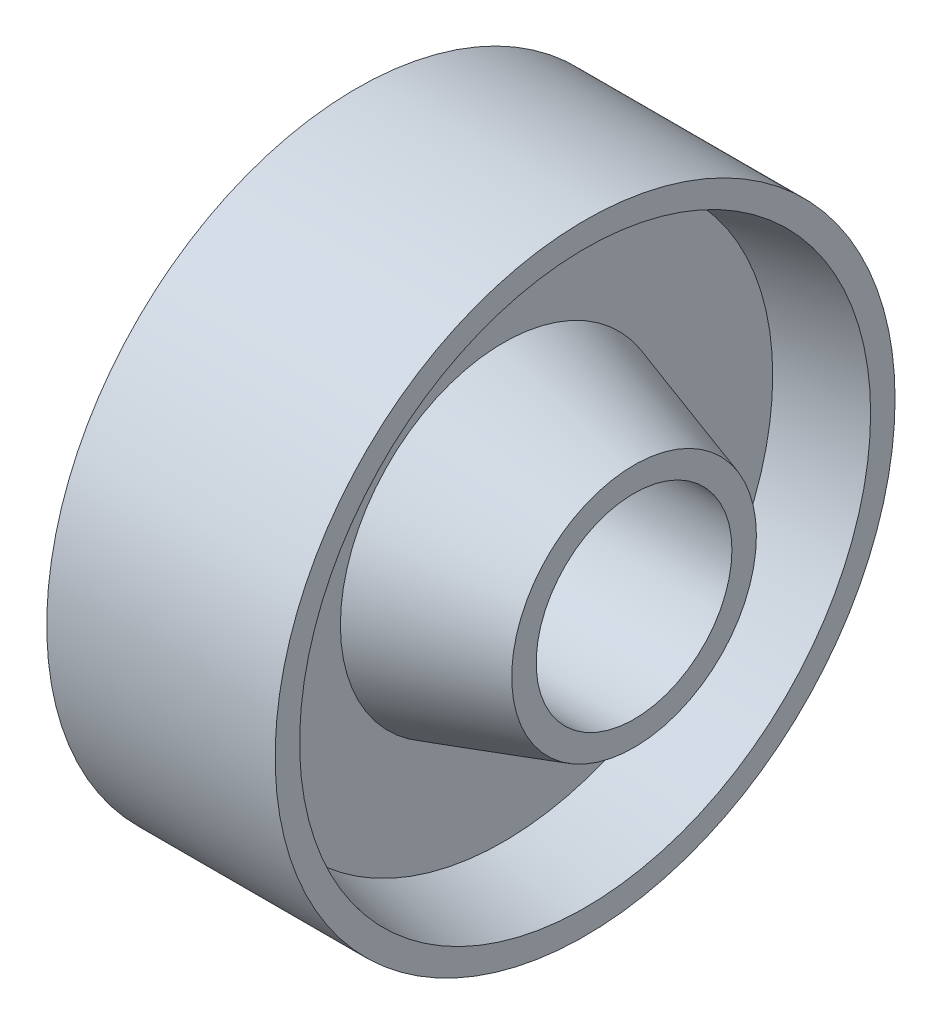
ISO-10303-21;
HEADER;
FILE_DESCRIPTION(('STEP AP214'),'2;1');
FILE_NAME('part.step','',(''),(''),'','','');
FILE_SCHEMA(('AUTOMOTIVE_DESIGN { 1 0 10303 214 1 1 1 1 }'));
ENDSEC;
DATA;
#1=APPLICATION_CONTEXT('core data for automotive mechanical design processes');
#2=APPLICATION_PROTOCOL_DEFINITION('international standard','automotive_design',2000,#1);
#3=PRODUCT_CONTEXT('',#1,'mechanical');
#4=PRODUCT('Part','Part','',(#3));
#5=PRODUCT_RELATED_PRODUCT_CATEGORY('part','',(#4));
#6=PRODUCT_DEFINITION_FORMATION('','',#4);
#7=PRODUCT_DEFINITION_CONTEXT('part definition',#1,'design');
#8=PRODUCT_DEFINITION('design','',#6,#7);
#9=PRODUCT_DEFINITION_SHAPE('','',#8);
#10=(LENGTH_UNIT() NAMED_UNIT(*) SI_UNIT(.MILLI.,.METRE.));
#11=(NAMED_UNIT(*) PLANE_ANGLE_UNIT() SI_UNIT($,.RADIAN.));
#12=(NAMED_UNIT(*) SI_UNIT($,.STERADIAN.) SOLID_ANGLE_UNIT());
#13=UNCERTAINTY_MEASURE_WITH_UNIT(LENGTH_MEASURE(1.E-05),#10,'distance_accuracy_value','');
#14=(GEOMETRIC_REPRESENTATION_CONTEXT(3) GLOBAL_UNCERTAINTY_ASSIGNED_CONTEXT((#13)) GLOBAL_UNIT_ASSIGNED_CONTEXT((#10,
#11,#12)) REPRESENTATION_CONTEXT('',''));
#15=CARTESIAN_POINT('',(0.,0.,0.));
#16=DIRECTION('',(0.,0.,1.));
#17=DIRECTION('',(1.,0.,0.));
#18=AXIS2_PLACEMENT_3D('',#15,#16,#17);
#19=CARTESIAN_POINT('',(90.0086496402296,0.,0.));
#20=DIRECTION('',(1.,0.,0.));
#21=DIRECTION('',(0.,0.,-1.));
#22=AXIS2_PLACEMENT_3D('',#19,#20,#21);
#23=CYLINDRICAL_SURFACE('',#22,12.);
#24=CARTESIAN_POINT('',(20.,0.,0.));
#25=DIRECTION('',(1.,0.,0.));
#26=DIRECTION('',(0.,0.,-1.));
#27=AXIS2_PLACEMENT_3D('',#24,#25,#26);
#28=CIRCLE('',#27,12.);
#29=CARTESIAN_POINT('',(20.,0.,-12.));
#30=VERTEX_POINT('',#29);
#31=EDGE_CURVE('E10',#30,#30,#28,.T.);
#32=ORIENTED_EDGE('',*,*,#31,.T.);
#33=EDGE_LOOP('',(#32));
#34=FACE_BOUND('',#33,.T.);
#35=CARTESIAN_POINT('',(-20.,0.,0.));
#36=DIRECTION('',(1.,0.,0.));
#37=DIRECTION('',(0.,0.,-1.));
#38=AXIS2_PLACEMENT_3D('',#35,#36,#37);
#39=CIRCLE('',#38,12.);
#40=CARTESIAN_POINT('',(-20.,0.,-12.));
#41=VERTEX_POINT('',#40);
#42=EDGE_CURVE('E71',#41,#41,#39,.T.);
#43=ORIENTED_EDGE('',*,*,#42,.F.);
#44=EDGE_LOOP('',(#43));
#45=FACE_BOUND('',#44,.T.);
#46=ADVANCED_FACE('F31',(#34,#45),#23,.F.);
#47=CARTESIAN_POINT('',(20.,12.,0.));
#48=DIRECTION('',(1.,0.,0.));
#49=DIRECTION('',(0.,0.,-1.));
#50=AXIS2_PLACEMENT_3D('',#47,#48,#49);
#51=PLANE('',#50);
#52=CARTESIAN_POINT('',(20.,0.,0.));
#53=DIRECTION('',(1.,0.,0.));
#54=DIRECTION('',(0.,0.,-1.));
#55=AXIS2_PLACEMENT_3D('',#52,#53,#54);
#56=CIRCLE('',#55,15.);
#57=CARTESIAN_POINT('',(20.,0.,-15.));
#58=VERTEX_POINT('',#57);
#59=EDGE_CURVE('E37',#58,#58,#56,.T.);
#60=ORIENTED_EDGE('',*,*,#59,.T.);
#61=EDGE_LOOP('',(#60));
#62=FACE_BOUND('',#61,.T.);
#63=ORIENTED_EDGE('',*,*,#31,.F.);
#64=EDGE_LOOP('',(#63));
#65=FACE_BOUND('',#64,.T.);
#66=ADVANCED_FACE('F79',(#62,#65),#51,.T.);
#67=CARTESIAN_POINT('',(20.,0.,0.));
#68=DIRECTION('',(-1.,0.,0.));
#69=DIRECTION('',(0.,0.,1.));
#70=AXIS2_PLACEMENT_3D('',#67,#68,#69);
#71=CONICAL_SURFACE('',#70,15.,0.302884868374971);
#72=CARTESIAN_POINT('',(4.,0.,0.));
#73=DIRECTION('',(1.,0.,0.));
#74=DIRECTION('',(0.,0.,-1.));
#75=AXIS2_PLACEMENT_3D('',#72,#73,#74);
#76=CIRCLE('',#75,20.);
#77=CARTESIAN_POINT('',(4.,0.,-20.));
#78=VERTEX_POINT('',#77);
#79=EDGE_CURVE('E41',#78,#78,#76,.T.);
#80=ORIENTED_EDGE('',*,*,#79,.T.);
#81=EDGE_LOOP('',(#80));
#82=FACE_BOUND('',#81,.T.);
#83=ORIENTED_EDGE('',*,*,#59,.F.);
#84=EDGE_LOOP('',(#83));
#85=FACE_BOUND('',#84,.T.);
#86=ADVANCED_FACE('F83',(#82,#85),#71,.T.);
#87=CARTESIAN_POINT('',(4.,20.,0.));
#88=DIRECTION('',(1.,0.,0.));
#89=DIRECTION('',(0.,0.,-1.));
#90=AXIS2_PLACEMENT_3D('',#87,#88,#89);
#91=PLANE('',#90);
#92=CARTESIAN_POINT('',(4.,0.,0.));
#93=DIRECTION('',(1.,0.,0.));
#94=DIRECTION('',(0.,0.,-1.));
#95=AXIS2_PLACEMENT_3D('',#92,#93,#94);
#96=CIRCLE('',#95,33.);
#97=CARTESIAN_POINT('',(4.,0.,-33.));
#98=VERTEX_POINT('',#97);
#99=EDGE_CURVE('E45',#98,#98,#96,.T.);
#100=ORIENTED_EDGE('',*,*,#99,.T.);
#101=EDGE_LOOP('',(#100));
#102=FACE_BOUND('',#101,.T.);
#103=ORIENTED_EDGE('',*,*,#79,.F.);
#104=EDGE_LOOP('',(#103));
#105=FACE_BOUND('',#104,.T.);
#106=ADVANCED_FACE('F87',(#102,#105),#91,.T.);
#107=CARTESIAN_POINT('',(4.,0.,0.));
#108=DIRECTION('',(1.,0.,0.));
#109=DIRECTION('',(0.,0.,-1.));
#110=AXIS2_PLACEMENT_3D('',#107,#108,#109);
#111=CONICAL_SURFACE('',#110,33.,0.197395559849881);
#112=CARTESIAN_POINT('',(14.,0.,0.));
#113=DIRECTION('',(1.,0.,0.));
#114=DIRECTION('',(0.,0.,-1.));
#115=AXIS2_PLACEMENT_3D('',#112,#113,#114);
#116=CIRCLE('',#115,35.);
#117=CARTESIAN_POINT('',(14.,0.,-35.));
#118=VERTEX_POINT('',#117);
#119=EDGE_CURVE('E50',#118,#118,#116,.T.);
#120=ORIENTED_EDGE('',*,*,#119,.T.);
#121=EDGE_LOOP('',(#120));
#122=FACE_BOUND('',#121,.T.);
#123=ORIENTED_EDGE('',*,*,#99,.F.);
#124=EDGE_LOOP('',(#123));
#125=FACE_BOUND('',#124,.T.);
#126=ADVANCED_FACE('F94',(#122,#125),#111,.F.);
#127=CARTESIAN_POINT('',(14.,35.,0.));
#128=DIRECTION('',(1.,0.,0.));
#129=DIRECTION('',(0.,0.,-1.));
#130=AXIS2_PLACEMENT_3D('',#127,#128,#129);
#131=PLANE('',#130);
#132=CARTESIAN_POINT('',(14.,0.,0.));
#133=DIRECTION('',(1.,0.,0.));
#134=DIRECTION('',(0.,0.,-1.));
#135=AXIS2_PLACEMENT_3D('',#132,#133,#134);
#136=CIRCLE('',#135,38.);
#137=CARTESIAN_POINT('',(14.,0.,-38.));
#138=VERTEX_POINT('',#137);
#139=EDGE_CURVE('E53',#138,#138,#136,.T.);
#140=ORIENTED_EDGE('',*,*,#139,.T.);
#141=EDGE_LOOP('',(#140));
#142=FACE_BOUND('',#141,.T.);
#143=ORIENTED_EDGE('',*,*,#119,.F.);
#144=EDGE_LOOP('',(#143));
#145=FACE_BOUND('',#144,.T.);
#146=ADVANCED_FACE('F98',(#142,#145),#131,.T.);
#147=CARTESIAN_POINT('',(90.0086496402296,0.,0.));
#148=DIRECTION('',(1.,0.,0.));
#149=DIRECTION('',(0.,0.,-1.));
#150=AXIS2_PLACEMENT_3D('',#147,#148,#149);
#151=CYLINDRICAL_SURFACE('',#150,38.);
#152=CARTESIAN_POINT('',(-14.,0.,0.));
#153=DIRECTION('',(1.,0.,0.));
#154=DIRECTION('',(0.,0.,-1.));
#155=AXIS2_PLACEMENT_3D('',#152,#153,#154);
#156=CIRCLE('',#155,38.);
#157=CARTESIAN_POINT('',(-14.,0.,-38.));
#158=VERTEX_POINT('',#157);
#159=EDGE_CURVE('E56',#158,#158,#156,.T.);
#160=ORIENTED_EDGE('',*,*,#159,.T.);
#161=EDGE_LOOP('',(#160));
#162=FACE_BOUND('',#161,.T.);
#163=ORIENTED_EDGE('',*,*,#139,.F.);
#164=EDGE_LOOP('',(#163));
#165=FACE_BOUND('',#164,.T.);
#166=ADVANCED_FACE('F102',(#162,#165),#151,.T.);
#167=CARTESIAN_POINT('',(-14.,35.,0.));
#168=DIRECTION('',(-1.,0.,0.));
#169=DIRECTION('',(0.,0.,1.));
#170=AXIS2_PLACEMENT_3D('',#167,#168,#169);
#171=PLANE('',#170);
#172=CARTESIAN_POINT('',(-14.,0.,0.));
#173=DIRECTION('',(1.,0.,0.));
#174=DIRECTION('',(0.,0.,-1.));
#175=AXIS2_PLACEMENT_3D('',#172,#173,#174);
#176=CIRCLE('',#175,35.);
#177=CARTESIAN_POINT('',(-14.,0.,-35.));
#178=VERTEX_POINT('',#177);
#179=EDGE_CURVE('E59',#178,#178,#176,.T.);
#180=ORIENTED_EDGE('',*,*,#179,.T.);
#181=EDGE_LOOP('',(#180));
#182=FACE_BOUND('',#181,.T.);
#183=ORIENTED_EDGE('',*,*,#159,.F.);
#184=EDGE_LOOP('',(#183));
#185=FACE_BOUND('',#184,.T.);
#186=ADVANCED_FACE('F106',(#182,#185),#171,.T.);
#187=CARTESIAN_POINT('',(-14.,0.,0.));
#188=DIRECTION('',(-1.,0.,0.));
#189=DIRECTION('',(0.,0.,1.));
#190=AXIS2_PLACEMENT_3D('',#187,#188,#189);
#191=CONICAL_SURFACE('',#190,35.,0.197395559849881);
#192=CARTESIAN_POINT('',(-4.,0.,0.));
#193=DIRECTION('',(1.,0.,0.));
#194=DIRECTION('',(0.,0.,-1.));
#195=AXIS2_PLACEMENT_3D('',#192,#193,#194);
#196=CIRCLE('',#195,33.);
#197=CARTESIAN_POINT('',(-4.,0.,-33.));
#198=VERTEX_POINT('',#197);
#199=EDGE_CURVE('E62',#198,#198,#196,.T.);
#200=ORIENTED_EDGE('',*,*,#199,.T.);
#201=EDGE_LOOP('',(#200));
#202=FACE_BOUND('',#201,.T.);
#203=ORIENTED_EDGE('',*,*,#179,.F.);
#204=EDGE_LOOP('',(#203));
#205=FACE_BOUND('',#204,.T.);
#206=ADVANCED_FACE('F110',(#202,#205),#191,.F.);
#207=CARTESIAN_POINT('',(-4.,20.,0.));
#208=DIRECTION('',(-1.,0.,0.));
#209=DIRECTION('',(0.,0.,1.));
#210=AXIS2_PLACEMENT_3D('',#207,#208,#209);
#211=PLANE('',#210);
#212=CARTESIAN_POINT('',(-4.,0.,0.));
#213=DIRECTION('',(1.,0.,0.));
#214=DIRECTION('',(0.,0.,-1.));
#215=AXIS2_PLACEMENT_3D('',#212,#213,#214);
#216=CIRCLE('',#215,20.);
#217=CARTESIAN_POINT('',(-4.,0.,-20.));
#218=VERTEX_POINT('',#217);
#219=EDGE_CURVE('E65',#218,#218,#216,.T.);
#220=ORIENTED_EDGE('',*,*,#219,.T.);
#221=EDGE_LOOP('',(#220));
#222=FACE_BOUND('',#221,.T.);
#223=ORIENTED_EDGE('',*,*,#199,.F.);
#224=EDGE_LOOP('',(#223));
#225=FACE_BOUND('',#224,.T.);
#226=ADVANCED_FACE('F114',(#222,#225),#211,.T.);
#227=CARTESIAN_POINT('',(-4.,0.,0.));
#228=DIRECTION('',(1.,0.,0.));
#229=DIRECTION('',(0.,0.,-1.));
#230=AXIS2_PLACEMENT_3D('',#227,#228,#229);
#231=CONICAL_SURFACE('',#230,20.,0.302884868374971);
#232=CARTESIAN_POINT('',(-20.,0.,0.));
#233=DIRECTION('',(1.,0.,0.));
#234=DIRECTION('',(0.,0.,-1.));
#235=AXIS2_PLACEMENT_3D('',#232,#233,#234);
#236=CIRCLE('',#235,15.);
#237=CARTESIAN_POINT('',(-20.,0.,-15.));
#238=VERTEX_POINT('',#237);
#239=EDGE_CURVE('E68',#238,#238,#236,.T.);
#240=ORIENTED_EDGE('',*,*,#239,.T.);
#241=EDGE_LOOP('',(#240));
#242=FACE_BOUND('',#241,.T.);
#243=ORIENTED_EDGE('',*,*,#219,.F.);
#244=EDGE_LOOP('',(#243));
#245=FACE_BOUND('',#244,.T.);
#246=ADVANCED_FACE('F118',(#242,#245),#231,.T.);
#247=CARTESIAN_POINT('',(-20.,12.,0.));
#248=DIRECTION('',(-1.,0.,0.));
#249=DIRECTION('',(0.,0.,1.));
#250=AXIS2_PLACEMENT_3D('',#247,#248,#249);
#251=PLANE('',#250);
#252=ORIENTED_EDGE('',*,*,#42,.T.);
#253=EDGE_LOOP('',(#252));
#254=FACE_BOUND('',#253,.T.);
#255=ORIENTED_EDGE('',*,*,#239,.F.);
#256=EDGE_LOOP('',(#255));
#257=FACE_BOUND('',#256,.T.);
#258=ADVANCED_FACE('F75',(#254,#257),#251,.T.);
#259=CLOSED_SHELL('',(#46,#66,#86,#106,#126,#146,#166,#186,#206,#226,#246,#258));
#260=MANIFOLD_SOLID_BREP('B2',#259);
#261=ADVANCED_BREP_SHAPE_REPRESENTATION('',(#18,#260),#14);
#262=SHAPE_DEFINITION_REPRESENTATION(#9,#261);
ENDSEC;
END-ISO-10303-21;
